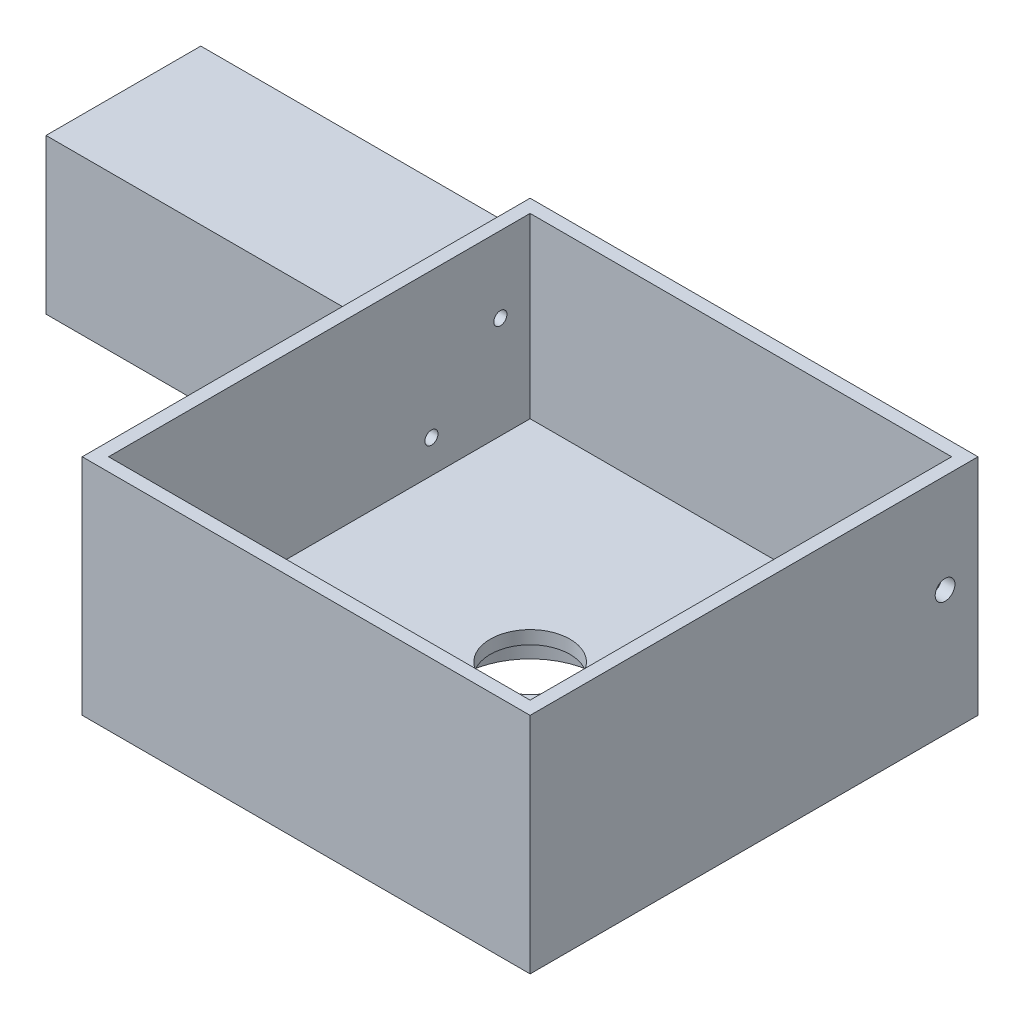
ISO-10303-21;
HEADER;
FILE_DESCRIPTION(('STEP AP214'),'2;1');
FILE_NAME('part.step','',(''),(''),'','','');
FILE_SCHEMA(('AUTOMOTIVE_DESIGN { 1 0 10303 214 1 1 1 1 }'));
ENDSEC;
DATA;
#1=APPLICATION_CONTEXT('core data for automotive mechanical design processes');
#2=APPLICATION_PROTOCOL_DEFINITION('international standard','automotive_design',2000,#1);
#3=PRODUCT_CONTEXT('',#1,'mechanical');
#4=PRODUCT('Part','Part','',(#3));
#5=PRODUCT_RELATED_PRODUCT_CATEGORY('part','',(#4));
#6=PRODUCT_DEFINITION_FORMATION('','',#4);
#7=PRODUCT_DEFINITION_CONTEXT('part definition',#1,'design');
#8=PRODUCT_DEFINITION('design','',#6,#7);
#9=PRODUCT_DEFINITION_SHAPE('','',#8);
#10=(LENGTH_UNIT() NAMED_UNIT(*) SI_UNIT(.MILLI.,.METRE.));
#11=(NAMED_UNIT(*) PLANE_ANGLE_UNIT() SI_UNIT($,.RADIAN.));
#12=(NAMED_UNIT(*) SI_UNIT($,.STERADIAN.) SOLID_ANGLE_UNIT());
#13=UNCERTAINTY_MEASURE_WITH_UNIT(LENGTH_MEASURE(1.E-05),#10,'distance_accuracy_value','');
#14=(GEOMETRIC_REPRESENTATION_CONTEXT(3) GLOBAL_UNCERTAINTY_ASSIGNED_CONTEXT((#13)) GLOBAL_UNIT_ASSIGNED_CONTEXT((#10,
#11,#12)) REPRESENTATION_CONTEXT('',''));
#15=CARTESIAN_POINT('',(0.,0.,0.));
#16=DIRECTION('',(0.,0.,1.));
#17=DIRECTION('',(1.,0.,0.));
#18=AXIS2_PLACEMENT_3D('',#15,#16,#17);
#19=CARTESIAN_POINT('',(34.,34.,34.));
#20=DIRECTION('',(-1.,0.,0.));
#21=DIRECTION('',(0.,0.,1.));
#22=AXIS2_PLACEMENT_3D('',#19,#20,#21);
#23=PLANE('',#22);
#24=CARTESIAN_POINT('',(34.,19.,-29.));
#25=DIRECTION('',(-1.,0.,0.));
#26=DIRECTION('',(0.,0.,1.));
#27=AXIS2_PLACEMENT_3D('',#24,#25,#26);
#28=CIRCLE('',#27,1.5);
#29=CARTESIAN_POINT('',(34.,19.,-27.5));
#30=VERTEX_POINT('',#29);
#31=EDGE_CURVE('E236',#30,#30,#28,.T.);
#32=ORIENTED_EDGE('',*,*,#31,.T.);
#33=EDGE_LOOP('',(#32));
#34=FACE_BOUND('',#33,.T.);
#35=DIRECTION('',(0.,0.,-1.));
#36=VECTOR('',#35,1.);
#37=CARTESIAN_POINT('',(34.,0.,34.));
#38=LINE('',#37,#36);
#39=CARTESIAN_POINT('',(34.,0.,34.));
#40=VERTEX_POINT('',#39);
#41=CARTESIAN_POINT('',(34.,0.,-34.));
#42=VERTEX_POINT('',#41);
#43=EDGE_CURVE('E349',#40,#42,#38,.T.);
#44=ORIENTED_EDGE('',*,*,#43,.T.);
#45=DIRECTION('',(0.,-1.,0.));
#46=VECTOR('',#45,1.);
#47=CARTESIAN_POINT('',(34.,34.,-34.));
#48=LINE('',#47,#46);
#49=CARTESIAN_POINT('',(34.,34.,-34.));
#50=VERTEX_POINT('',#49);
#51=EDGE_CURVE('E395',#50,#42,#48,.T.);
#52=ORIENTED_EDGE('',*,*,#51,.F.);
#53=DIRECTION('',(0.,0.,-1.));
#54=VECTOR('',#53,1.);
#55=CARTESIAN_POINT('',(34.,34.,34.));
#56=LINE('',#55,#54);
#57=CARTESIAN_POINT('',(34.,34.,34.));
#58=VERTEX_POINT('',#57);
#59=EDGE_CURVE('E359',#58,#50,#56,.T.);
#60=ORIENTED_EDGE('',*,*,#59,.F.);
#61=DIRECTION('',(0.,-1.,0.));
#62=VECTOR('',#61,1.);
#63=CARTESIAN_POINT('',(34.,34.,34.));
#64=LINE('',#63,#62);
#65=EDGE_CURVE('E373',#58,#40,#64,.T.);
#66=ORIENTED_EDGE('',*,*,#65,.T.);
#67=EDGE_LOOP('',(#44,#52,#60,#66));
#68=FACE_BOUND('',#67,.T.);
#69=ADVANCED_FACE('F39',(#34,#68),#23,.F.);
#70=CARTESIAN_POINT('',(-34.,34.,-34.));
#71=DIRECTION('',(0.,0.,1.));
#72=DIRECTION('',(1.,0.,0.));
#73=AXIS2_PLACEMENT_3D('',#70,#71,#72);
#74=PLANE('',#73);
#75=DIRECTION('',(-1.,0.,0.));
#76=VECTOR('',#75,1.);
#77=CARTESIAN_POINT('',(-34.,0.,-34.));
#78=LINE('',#77,#76);
#79=CARTESIAN_POINT('',(-34.,0.,-34.));
#80=VERTEX_POINT('',#79);
#81=EDGE_CURVE('E377',#42,#80,#78,.T.);
#82=ORIENTED_EDGE('',*,*,#81,.T.);
#83=DIRECTION('',(0.,-1.,0.));
#84=VECTOR('',#83,1.);
#85=CARTESIAN_POINT('',(-34.,34.,-34.));
#86=LINE('',#85,#84);
#87=CARTESIAN_POINT('',(-34.,5.5,-34.));
#88=VERTEX_POINT('',#87);
#89=EDGE_CURVE('E229',#88,#80,#86,.T.);
#90=ORIENTED_EDGE('',*,*,#89,.F.);
#91=DIRECTION('',(1.,0.,0.));
#92=VECTOR('',#91,1.);
#93=CARTESIAN_POINT('',(-84.,5.5,-34.));
#94=LINE('',#93,#92);
#95=CARTESIAN_POINT('',(-84.,5.5,-34.));
#96=VERTEX_POINT('',#95);
#97=EDGE_CURVE('E206',#96,#88,#94,.T.);
#98=ORIENTED_EDGE('',*,*,#97,.F.);
#99=DIRECTION('',(0.,-1.,0.));
#100=VECTOR('',#99,1.);
#101=CARTESIAN_POINT('',(-84.,5.5,-34.));
#102=LINE('',#101,#100);
#103=CARTESIAN_POINT('',(-84.,29.,-34.));
#104=VERTEX_POINT('',#103);
#105=EDGE_CURVE('E213',#104,#96,#102,.T.);
#106=ORIENTED_EDGE('',*,*,#105,.F.);
#107=DIRECTION('',(1.,0.,0.));
#108=VECTOR('',#107,1.);
#109=CARTESIAN_POINT('',(-84.,29.,-34.));
#110=LINE('',#109,#108);
#111=CARTESIAN_POINT('',(-34.,29.,-34.));
#112=VERTEX_POINT('',#111);
#113=EDGE_CURVE('E825',#104,#112,#110,.T.);
#114=ORIENTED_EDGE('',*,*,#113,.T.);
#115=CARTESIAN_POINT('',(-34.,34.,-34.));
#116=VERTEX_POINT('',#115);
#117=EDGE_CURVE('E392',#116,#112,#86,.T.);
#118=ORIENTED_EDGE('',*,*,#117,.F.);
#119=DIRECTION('',(-1.,0.,0.));
#120=VECTOR('',#119,1.);
#121=CARTESIAN_POINT('',(-34.,34.,-34.));
#122=LINE('',#121,#120);
#123=EDGE_CURVE('E363',#50,#116,#122,.T.);
#124=ORIENTED_EDGE('',*,*,#123,.F.);
#125=ORIENTED_EDGE('',*,*,#51,.T.);
#126=EDGE_LOOP('',(#82,#90,#98,#106,#114,#118,#124,#125));
#127=FACE_BOUND('',#126,.T.);
#128=ADVANCED_FACE('F228',(#127),#74,.F.);
#129=CARTESIAN_POINT('',(-34.,34.,34.));
#130=DIRECTION('',(1.,0.,0.));
#131=DIRECTION('',(0.,0.,-1.));
#132=AXIS2_PLACEMENT_3D('',#129,#130,#131);
#133=PLANE('',#132);
#134=DIRECTION('',(0.,0.,-1.));
#135=VECTOR('',#134,1.);
#136=CARTESIAN_POINT('',(-34.,29.,-34.));
#137=LINE('',#136,#135);
#138=CARTESIAN_POINT('',(-34.,29.,-10.5));
#139=VERTEX_POINT('',#138);
#140=EDGE_CURVE('E224',#139,#112,#137,.T.);
#141=ORIENTED_EDGE('',*,*,#140,.F.);
#142=DIRECTION('',(0.,1.,0.));
#143=VECTOR('',#142,1.);
#144=CARTESIAN_POINT('',(-34.,5.5,-10.5));
#145=LINE('',#144,#143);
#146=CARTESIAN_POINT('',(-34.,5.5,-10.5));
#147=VERTEX_POINT('',#146);
#148=EDGE_CURVE('E814',#147,#139,#145,.T.);
#149=ORIENTED_EDGE('',*,*,#148,.F.);
#150=DIRECTION('',(0.,0.,1.));
#151=VECTOR('',#150,1.);
#152=CARTESIAN_POINT('',(-34.,5.5,-34.));
#153=LINE('',#152,#151);
#154=EDGE_CURVE('E822',#88,#147,#153,.T.);
#155=ORIENTED_EDGE('',*,*,#154,.F.);
#156=ORIENTED_EDGE('',*,*,#89,.T.);
#157=DIRECTION('',(0.,0.,1.));
#158=VECTOR('',#157,1.);
#159=CARTESIAN_POINT('',(-34.,0.,34.));
#160=LINE('',#159,#158);
#161=CARTESIAN_POINT('',(-34.,0.,34.));
#162=VERTEX_POINT('',#161);
#163=EDGE_CURVE('E380',#80,#162,#160,.T.);
#164=ORIENTED_EDGE('',*,*,#163,.T.);
#165=DIRECTION('',(0.,-1.,0.));
#166=VECTOR('',#165,1.);
#167=CARTESIAN_POINT('',(-34.,34.,34.));
#168=LINE('',#167,#166);
#169=CARTESIAN_POINT('',(-34.,34.,34.));
#170=VERTEX_POINT('',#169);
#171=EDGE_CURVE('E388',#170,#162,#168,.T.);
#172=ORIENTED_EDGE('',*,*,#171,.F.);
#173=DIRECTION('',(0.,0.,1.));
#174=VECTOR('',#173,1.);
#175=CARTESIAN_POINT('',(-34.,34.,34.));
#176=LINE('',#175,#174);
#177=EDGE_CURVE('E367',#116,#170,#176,.T.);
#178=ORIENTED_EDGE('',*,*,#177,.F.);
#179=ORIENTED_EDGE('',*,*,#117,.T.);
#180=EDGE_LOOP('',(#141,#149,#155,#156,#164,#172,#178,#179));
#181=FACE_BOUND('',#180,.T.);
#182=ADVANCED_FACE('F524',(#181),#133,.F.);
#183=CARTESIAN_POINT('',(-34.,34.,34.));
#184=DIRECTION('',(0.,0.,-1.));
#185=DIRECTION('',(-1.,0.,0.));
#186=AXIS2_PLACEMENT_3D('',#183,#184,#185);
#187=PLANE('',#186);
#188=DIRECTION('',(1.,0.,0.));
#189=VECTOR('',#188,1.);
#190=CARTESIAN_POINT('',(-34.,0.,34.));
#191=LINE('',#190,#189);
#192=EDGE_CURVE('E364',#162,#40,#191,.T.);
#193=ORIENTED_EDGE('',*,*,#192,.T.);
#194=ORIENTED_EDGE('',*,*,#65,.F.);
#195=DIRECTION('',(1.,0.,0.));
#196=VECTOR('',#195,1.);
#197=CARTESIAN_POINT('',(-34.,34.,34.));
#198=LINE('',#197,#196);
#199=EDGE_CURVE('E370',#170,#58,#198,.T.);
#200=ORIENTED_EDGE('',*,*,#199,.F.);
#201=ORIENTED_EDGE('',*,*,#171,.T.);
#202=EDGE_LOOP('',(#193,#194,#200,#201));
#203=FACE_BOUND('',#202,.T.);
#204=ADVANCED_FACE('F805',(#203),#187,.F.);
#205=CARTESIAN_POINT('',(0.,34.,0.));
#206=DIRECTION('',(0.,-1.,0.));
#207=DIRECTION('',(0.,0.,-1.));
#208=AXIS2_PLACEMENT_3D('',#205,#206,#207);
#209=PLANE('',#208);
#210=DIRECTION('',(-1.,0.,0.));
#211=VECTOR('',#210,1.);
#212=CARTESIAN_POINT('',(0.,34.,-32.));
#213=LINE('',#212,#211);
#214=CARTESIAN_POINT('',(32.,34.,-32.));
#215=VERTEX_POINT('',#214);
#216=CARTESIAN_POINT('',(-32.,34.,-32.));
#217=VERTEX_POINT('',#216);
#218=EDGE_CURVE('E335',#215,#217,#213,.T.);
#219=ORIENTED_EDGE('',*,*,#218,.F.);
#220=DIRECTION('',(0.,0.,-1.));
#221=VECTOR('',#220,1.);
#222=CARTESIAN_POINT('',(32.,34.,0.));
#223=LINE('',#222,#221);
#224=CARTESIAN_POINT('',(32.,34.,32.));
#225=VERTEX_POINT('',#224);
#226=EDGE_CURVE('E311',#225,#215,#223,.T.);
#227=ORIENTED_EDGE('',*,*,#226,.F.);
#228=DIRECTION('',(1.,0.,0.));
#229=VECTOR('',#228,1.);
#230=CARTESIAN_POINT('',(0.,34.,32.));
#231=LINE('',#230,#229);
#232=CARTESIAN_POINT('',(-32.,34.,32.));
#233=VERTEX_POINT('',#232);
#234=EDGE_CURVE('E320',#233,#225,#231,.T.);
#235=ORIENTED_EDGE('',*,*,#234,.F.);
#236=DIRECTION('',(0.,0.,1.));
#237=VECTOR('',#236,1.);
#238=CARTESIAN_POINT('',(-32.,34.,0.));
#239=LINE('',#238,#237);
#240=EDGE_CURVE('E339',#217,#233,#239,.T.);
#241=ORIENTED_EDGE('',*,*,#240,.F.);
#242=EDGE_LOOP('',(#219,#227,#235,#241));
#243=FACE_BOUND('',#242,.T.);
#244=ORIENTED_EDGE('',*,*,#59,.T.);
#245=ORIENTED_EDGE('',*,*,#123,.T.);
#246=ORIENTED_EDGE('',*,*,#177,.T.);
#247=ORIENTED_EDGE('',*,*,#199,.T.);
#248=EDGE_LOOP('',(#244,#245,#246,#247));
#249=FACE_BOUND('',#248,.T.);
#250=ADVANCED_FACE('F744',(#243,#249),#209,.F.);
#251=CARTESIAN_POINT('',(0.,0.,0.));
#252=DIRECTION('',(0.,-1.,0.));
#253=DIRECTION('',(0.,0.,-1.));
#254=AXIS2_PLACEMENT_3D('',#251,#252,#253);
#255=PLANE('',#254);
#256=DIRECTION('',(0.,0.,-1.));
#257=VECTOR('',#256,1.);
#258=CARTESIAN_POINT('',(-15.5,0.,15.));
#259=LINE('',#258,#257);
#260=CARTESIAN_POINT('',(-15.5,0.,-15.5));
#261=VERTEX_POINT('',#260);
#262=CARTESIAN_POINT('',(-15.5,0.,15.5));
#263=VERTEX_POINT('',#262);
#264=EDGE_CURVE('E435',#261,#263,#259,.F.);
#265=ORIENTED_EDGE('',*,*,#264,.T.);
#266=DIRECTION('',(-1.,0.,0.));
#267=VECTOR('',#266,1.);
#268=CARTESIAN_POINT('',(15.,0.,15.5));
#269=LINE('',#268,#267);
#270=CARTESIAN_POINT('',(15.5,0.,15.5));
#271=VERTEX_POINT('',#270);
#272=EDGE_CURVE('E444',#263,#271,#269,.F.);
#273=ORIENTED_EDGE('',*,*,#272,.T.);
#274=DIRECTION('',(0.,0.,1.));
#275=VECTOR('',#274,1.);
#276=CARTESIAN_POINT('',(15.5,0.,-15.));
#277=LINE('',#276,#275);
#278=CARTESIAN_POINT('',(15.5,0.,-15.5));
#279=VERTEX_POINT('',#278);
#280=EDGE_CURVE('E441',#271,#279,#277,.F.);
#281=ORIENTED_EDGE('',*,*,#280,.T.);
#282=DIRECTION('',(1.,0.,0.));
#283=VECTOR('',#282,1.);
#284=CARTESIAN_POINT('',(-15.,0.,-15.5));
#285=LINE('',#284,#283);
#286=EDGE_CURVE('E438',#279,#261,#285,.F.);
#287=ORIENTED_EDGE('',*,*,#286,.T.);
#288=EDGE_LOOP('',(#265,#273,#281,#287));
#289=FACE_BOUND('',#288,.T.);
#290=ORIENTED_EDGE('',*,*,#43,.F.);
#291=ORIENTED_EDGE('',*,*,#192,.F.);
#292=ORIENTED_EDGE('',*,*,#163,.F.);
#293=ORIENTED_EDGE('',*,*,#81,.F.);
#294=EDGE_LOOP('',(#290,#291,#292,#293));
#295=FACE_BOUND('',#294,.T.);
#296=ADVANCED_FACE('F488',(#289,#295),#255,.T.);
#297=CARTESIAN_POINT('',(32.,7.,0.));
#298=DIRECTION('',(1.,0.,0.));
#299=DIRECTION('',(0.,0.,-1.));
#300=AXIS2_PLACEMENT_3D('',#297,#298,#299);
#301=PLANE('',#300);
#302=CARTESIAN_POINT('',(32.,19.,-29.));
#303=DIRECTION('',(-1.,0.,0.));
#304=DIRECTION('',(0.,0.,1.));
#305=AXIS2_PLACEMENT_3D('',#302,#303,#304);
#306=CIRCLE('',#305,1.5);
#307=CARTESIAN_POINT('',(32.,19.,-27.5));
#308=VERTEX_POINT('',#307);
#309=EDGE_CURVE('E231',#308,#308,#306,.T.);
#310=ORIENTED_EDGE('',*,*,#309,.F.);
#311=EDGE_LOOP('',(#310));
#312=FACE_BOUND('',#311,.T.);
#313=ORIENTED_EDGE('',*,*,#226,.T.);
#314=DIRECTION('',(0.,1.,0.));
#315=VECTOR('',#314,1.);
#316=CARTESIAN_POINT('',(32.,7.,-32.));
#317=LINE('',#316,#315);
#318=CARTESIAN_POINT('',(32.,7.,-32.));
#319=VERTEX_POINT('',#318);
#320=EDGE_CURVE('E332',#319,#215,#317,.T.);
#321=ORIENTED_EDGE('',*,*,#320,.F.);
#322=DIRECTION('',(0.,0.,-1.));
#323=VECTOR('',#322,1.);
#324=CARTESIAN_POINT('',(32.,7.,0.));
#325=LINE('',#324,#323);
#326=CARTESIAN_POINT('',(32.,7.,32.));
#327=VERTEX_POINT('',#326);
#328=EDGE_CURVE('E315',#327,#319,#325,.T.);
#329=ORIENTED_EDGE('',*,*,#328,.F.);
#330=DIRECTION('',(0.,1.,0.));
#331=VECTOR('',#330,1.);
#332=CARTESIAN_POINT('',(32.,7.,32.));
#333=LINE('',#332,#331);
#334=EDGE_CURVE('E346',#327,#225,#333,.T.);
#335=ORIENTED_EDGE('',*,*,#334,.T.);
#336=EDGE_LOOP('',(#313,#321,#329,#335));
#337=FACE_BOUND('',#336,.T.);
#338=ADVANCED_FACE('F743',(#312,#337),#301,.F.);
#339=CARTESIAN_POINT('',(0.,7.,32.));
#340=DIRECTION('',(0.,0.,1.));
#341=DIRECTION('',(1.,0.,0.));
#342=AXIS2_PLACEMENT_3D('',#339,#340,#341);
#343=PLANE('',#342);
#344=ORIENTED_EDGE('',*,*,#234,.T.);
#345=ORIENTED_EDGE('',*,*,#334,.F.);
#346=DIRECTION('',(1.,0.,0.));
#347=VECTOR('',#346,1.);
#348=CARTESIAN_POINT('',(0.,7.,32.));
#349=LINE('',#348,#347);
#350=CARTESIAN_POINT('',(-32.,7.,32.));
#351=VERTEX_POINT('',#350);
#352=EDGE_CURVE('E328',#351,#327,#349,.T.);
#353=ORIENTED_EDGE('',*,*,#352,.F.);
#354=DIRECTION('',(0.,1.,0.));
#355=VECTOR('',#354,1.);
#356=CARTESIAN_POINT('',(-32.,7.,32.));
#357=LINE('',#356,#355);
#358=EDGE_CURVE('E350',#351,#233,#357,.T.);
#359=ORIENTED_EDGE('',*,*,#358,.T.);
#360=EDGE_LOOP('',(#344,#345,#353,#359));
#361=FACE_BOUND('',#360,.T.);
#362=ADVANCED_FACE('F757',(#361),#343,.F.);
#363=CARTESIAN_POINT('',(-32.,7.,0.));
#364=DIRECTION('',(-1.,0.,0.));
#365=DIRECTION('',(0.,0.,1.));
#366=AXIS2_PLACEMENT_3D('',#363,#364,#365);
#367=PLANE('',#366);
#368=CARTESIAN_POINT('',(-32.,22.4825901807804,-27.4825901807805));
#369=DIRECTION('',(-1.,0.,0.));
#370=DIRECTION('',(0.,0.,1.));
#371=AXIS2_PLACEMENT_3D('',#368,#369,#370);
#372=CIRCLE('',#371,1.);
#373=CARTESIAN_POINT('',(-32.,22.4825901807804,-26.4825901807805));
#374=VERTEX_POINT('',#373);
#375=EDGE_CURVE('E840',#374,#374,#372,.T.);
#376=ORIENTED_EDGE('',*,*,#375,.T.);
#377=EDGE_LOOP('',(#376));
#378=FACE_BOUND('',#377,.T.);
#379=CARTESIAN_POINT('',(-32.,12.0174098192195,-17.0174098192196));
#380=DIRECTION('',(-1.,0.,0.));
#381=DIRECTION('',(0.,0.,-1.));
#382=AXIS2_PLACEMENT_3D('',#379,#380,#381);
#383=CIRCLE('',#382,1.);
#384=CARTESIAN_POINT('',(-32.,12.0174098192195,-18.0174098192196));
#385=VERTEX_POINT('',#384);
#386=EDGE_CURVE('E848',#385,#385,#383,.T.);
#387=ORIENTED_EDGE('',*,*,#386,.T.);
#388=EDGE_LOOP('',(#387));
#389=FACE_BOUND('',#388,.T.);
#390=ORIENTED_EDGE('',*,*,#240,.T.);
#391=ORIENTED_EDGE('',*,*,#358,.F.);
#392=DIRECTION('',(0.,0.,1.));
#393=VECTOR('',#392,1.);
#394=CARTESIAN_POINT('',(-32.,7.,0.));
#395=LINE('',#394,#393);
#396=CARTESIAN_POINT('',(-32.,7.,-32.));
#397=VERTEX_POINT('',#396);
#398=EDGE_CURVE('E324',#397,#351,#395,.T.);
#399=ORIENTED_EDGE('',*,*,#398,.F.);
#400=DIRECTION('',(0.,1.,0.));
#401=VECTOR('',#400,1.);
#402=CARTESIAN_POINT('',(-32.,7.,-32.));
#403=LINE('',#402,#401);
#404=EDGE_CURVE('E353',#397,#217,#403,.T.);
#405=ORIENTED_EDGE('',*,*,#404,.T.);
#406=EDGE_LOOP('',(#390,#391,#399,#405));
#407=FACE_BOUND('',#406,.T.);
#408=ADVANCED_FACE('F764',(#378,#389,#407),#367,.F.);
#409=CARTESIAN_POINT('',(0.,7.,-32.));
#410=DIRECTION('',(0.,0.,-1.));
#411=DIRECTION('',(-1.,0.,0.));
#412=AXIS2_PLACEMENT_3D('',#409,#410,#411);
#413=PLANE('',#412);
#414=ORIENTED_EDGE('',*,*,#218,.T.);
#415=ORIENTED_EDGE('',*,*,#404,.F.);
#416=DIRECTION('',(-1.,0.,0.));
#417=VECTOR('',#416,1.);
#418=CARTESIAN_POINT('',(0.,7.,-32.));
#419=LINE('',#418,#417);
#420=EDGE_CURVE('E319',#319,#397,#419,.T.);
#421=ORIENTED_EDGE('',*,*,#420,.F.);
#422=ORIENTED_EDGE('',*,*,#320,.T.);
#423=EDGE_LOOP('',(#414,#415,#421,#422));
#424=FACE_BOUND('',#423,.T.);
#425=ADVANCED_FACE('F771',(#424),#413,.F.);
#426=CARTESIAN_POINT('',(0.,7.,0.));
#427=DIRECTION('',(0.,1.,0.));
#428=DIRECTION('',(0.,0.,1.));
#429=AXIS2_PLACEMENT_3D('',#426,#427,#428);
#430=PLANE('',#429);
#431=CARTESIAN_POINT('',(0.,7.,0.));
#432=DIRECTION('',(0.,1.,0.));
#433=DIRECTION('',(0.,0.,1.));
#434=AXIS2_PLACEMENT_3D('',#431,#432,#433);
#435=CIRCLE('',#434,6.05);
#436=CARTESIAN_POINT('',(0.,7.,6.05));
#437=VERTEX_POINT('',#436);
#438=EDGE_CURVE('E404',#437,#437,#435,.F.);
#439=ORIENTED_EDGE('',*,*,#438,.T.);
#440=EDGE_LOOP('',(#439));
#441=FACE_BOUND('',#440,.T.);
#442=ORIENTED_EDGE('',*,*,#328,.T.);
#443=ORIENTED_EDGE('',*,*,#420,.T.);
#444=ORIENTED_EDGE('',*,*,#398,.T.);
#445=ORIENTED_EDGE('',*,*,#352,.T.);
#446=EDGE_LOOP('',(#442,#443,#444,#445));
#447=FACE_BOUND('',#446,.T.);
#448=ADVANCED_FACE('F515',(#441,#447),#430,.T.);
#449=CARTESIAN_POINT('',(15.,2.,-15.));
#450=DIRECTION('',(1.,0.,0.));
#451=DIRECTION('',(0.,0.,-1.));
#452=AXIS2_PLACEMENT_3D('',#449,#450,#451);
#453=PLANE('',#452);
#454=DIRECTION('',(0.,-1.,0.));
#455=VECTOR('',#454,1.);
#456=CARTESIAN_POINT('',(15.,2.,-15.));
#457=LINE('',#456,#455);
#458=CARTESIAN_POINT('',(15.,2.,-15.));
#459=VERTEX_POINT('',#458);
#460=CARTESIAN_POINT('',(15.,0.5,-15.));
#461=VERTEX_POINT('',#460);
#462=EDGE_CURVE('E294',#459,#461,#457,.T.);
#463=ORIENTED_EDGE('',*,*,#462,.T.);
#464=DIRECTION('',(0.,0.,1.));
#465=VECTOR('',#464,1.);
#466=CARTESIAN_POINT('',(15.,0.5,15.));
#467=LINE('',#466,#465);
#468=CARTESIAN_POINT('',(15.,0.5,15.));
#469=VERTEX_POINT('',#468);
#470=EDGE_CURVE('E448',#461,#469,#467,.T.);
#471=ORIENTED_EDGE('',*,*,#470,.T.);
#472=DIRECTION('',(0.,-1.,0.));
#473=VECTOR('',#472,1.);
#474=CARTESIAN_POINT('',(15.,2.,15.));
#475=LINE('',#474,#473);
#476=CARTESIAN_POINT('',(15.,2.,15.));
#477=VERTEX_POINT('',#476);
#478=EDGE_CURVE('E293',#477,#469,#475,.T.);
#479=ORIENTED_EDGE('',*,*,#478,.F.);
#480=DIRECTION('',(0.,0.,1.));
#481=VECTOR('',#480,1.);
#482=CARTESIAN_POINT('',(15.,2.,-15.));
#483=LINE('',#482,#481);
#484=EDGE_CURVE('E266',#459,#477,#483,.T.);
#485=ORIENTED_EDGE('',*,*,#484,.F.);
#486=EDGE_LOOP('',(#463,#471,#479,#485));
#487=FACE_BOUND('',#486,.T.);
#488=ADVANCED_FACE('F506',(#487),#453,.F.);
#489=CARTESIAN_POINT('',(15.,2.,-15.));
#490=DIRECTION('',(0.,0.,-1.));
#491=DIRECTION('',(-1.,0.,0.));
#492=AXIS2_PLACEMENT_3D('',#489,#490,#491);
#493=PLANE('',#492);
#494=DIRECTION('',(0.,-1.,0.));
#495=VECTOR('',#494,1.);
#496=CARTESIAN_POINT('',(-15.,2.,-15.));
#497=LINE('',#496,#495);
#498=CARTESIAN_POINT('',(-15.,2.,-15.));
#499=VERTEX_POINT('',#498);
#500=CARTESIAN_POINT('',(-15.,0.5,-15.));
#501=VERTEX_POINT('',#500);
#502=EDGE_CURVE('E298',#499,#501,#497,.T.);
#503=ORIENTED_EDGE('',*,*,#502,.T.);
#504=DIRECTION('',(1.,0.,0.));
#505=VECTOR('',#504,1.);
#506=CARTESIAN_POINT('',(15.,0.5,-15.));
#507=LINE('',#506,#505);
#508=EDGE_CURVE('E49',#501,#461,#507,.T.);
#509=ORIENTED_EDGE('',*,*,#508,.T.);
#510=ORIENTED_EDGE('',*,*,#462,.F.);
#511=DIRECTION('',(1.,0.,0.));
#512=VECTOR('',#511,1.);
#513=CARTESIAN_POINT('',(15.,2.,-15.));
#514=LINE('',#513,#512);
#515=EDGE_CURVE('E289',#499,#459,#514,.T.);
#516=ORIENTED_EDGE('',*,*,#515,.F.);
#517=EDGE_LOOP('',(#503,#509,#510,#516));
#518=FACE_BOUND('',#517,.T.);
#519=ADVANCED_FACE('F507',(#518),#493,.F.);
#520=CARTESIAN_POINT('',(-15.,2.,-15.));
#521=DIRECTION('',(-1.,0.,0.));
#522=DIRECTION('',(0.,0.,1.));
#523=AXIS2_PLACEMENT_3D('',#520,#521,#522);
#524=PLANE('',#523);
#525=DIRECTION('',(0.,-1.,0.));
#526=VECTOR('',#525,1.);
#527=CARTESIAN_POINT('',(-15.,2.,15.));
#528=LINE('',#527,#526);
#529=CARTESIAN_POINT('',(-15.,2.,15.));
#530=VERTEX_POINT('',#529);
#531=CARTESIAN_POINT('',(-15.,0.5,15.));
#532=VERTEX_POINT('',#531);
#533=EDGE_CURVE('E301',#530,#532,#528,.T.);
#534=ORIENTED_EDGE('',*,*,#533,.T.);
#535=DIRECTION('',(0.,0.,-1.));
#536=VECTOR('',#535,1.);
#537=CARTESIAN_POINT('',(-15.,0.5,-15.));
#538=LINE('',#537,#536);
#539=EDGE_CURVE('E11',#532,#501,#538,.T.);
#540=ORIENTED_EDGE('',*,*,#539,.T.);
#541=ORIENTED_EDGE('',*,*,#502,.F.);
#542=DIRECTION('',(0.,0.,-1.));
#543=VECTOR('',#542,1.);
#544=CARTESIAN_POINT('',(-15.,2.,-15.));
#545=LINE('',#544,#543);
#546=EDGE_CURVE('E285',#530,#499,#545,.T.);
#547=ORIENTED_EDGE('',*,*,#546,.F.);
#548=EDGE_LOOP('',(#534,#540,#541,#547));
#549=FACE_BOUND('',#548,.T.);
#550=ADVANCED_FACE('F500',(#549),#524,.F.);
#551=CARTESIAN_POINT('',(15.,2.,15.));
#552=DIRECTION('',(0.,0.,1.));
#553=DIRECTION('',(1.,0.,0.));
#554=AXIS2_PLACEMENT_3D('',#551,#552,#553);
#555=PLANE('',#554);
#556=ORIENTED_EDGE('',*,*,#478,.T.);
#557=DIRECTION('',(-1.,0.,0.));
#558=VECTOR('',#557,1.);
#559=CARTESIAN_POINT('',(-15.,0.5,15.));
#560=LINE('',#559,#558);
#561=EDGE_CURVE('E431',#469,#532,#560,.T.);
#562=ORIENTED_EDGE('',*,*,#561,.T.);
#563=ORIENTED_EDGE('',*,*,#533,.F.);
#564=DIRECTION('',(-1.,0.,0.));
#565=VECTOR('',#564,1.);
#566=CARTESIAN_POINT('',(15.,2.,15.));
#567=LINE('',#566,#565);
#568=EDGE_CURVE('E281',#477,#530,#567,.T.);
#569=ORIENTED_EDGE('',*,*,#568,.F.);
#570=EDGE_LOOP('',(#556,#562,#563,#569));
#571=FACE_BOUND('',#570,.T.);
#572=ADVANCED_FACE('F497',(#571),#555,.F.);
#573=CARTESIAN_POINT('',(0.,2.,0.));
#574=DIRECTION('',(0.,-1.,0.));
#575=DIRECTION('',(0.,0.,-1.));
#576=AXIS2_PLACEMENT_3D('',#573,#574,#575);
#577=PLANE('',#576);
#578=DIRECTION('',(1.,0.,0.));
#579=VECTOR('',#578,1.);
#580=CARTESIAN_POINT('',(13.,2.,-13.));
#581=LINE('',#580,#579);
#582=CARTESIAN_POINT('',(-13.,2.,-13.));
#583=VERTEX_POINT('',#582);
#584=CARTESIAN_POINT('',(13.,2.,-13.));
#585=VERTEX_POINT('',#584);
#586=EDGE_CURVE('E257',#583,#585,#581,.T.);
#587=ORIENTED_EDGE('',*,*,#586,.F.);
#588=DIRECTION('',(0.,0.,-1.));
#589=VECTOR('',#588,1.);
#590=CARTESIAN_POINT('',(-13.,2.,-13.));
#591=LINE('',#590,#589);
#592=CARTESIAN_POINT('',(-13.,2.,13.));
#593=VERTEX_POINT('',#592);
#594=EDGE_CURVE('E253',#593,#583,#591,.T.);
#595=ORIENTED_EDGE('',*,*,#594,.F.);
#596=DIRECTION('',(-1.,0.,0.));
#597=VECTOR('',#596,1.);
#598=CARTESIAN_POINT('',(13.,2.,13.));
#599=LINE('',#598,#597);
#600=CARTESIAN_POINT('',(13.,2.,13.));
#601=VERTEX_POINT('',#600);
#602=EDGE_CURVE('E249',#601,#593,#599,.T.);
#603=ORIENTED_EDGE('',*,*,#602,.F.);
#604=DIRECTION('',(0.,0.,1.));
#605=VECTOR('',#604,1.);
#606=CARTESIAN_POINT('',(13.,2.,-13.));
#607=LINE('',#606,#605);
#608=EDGE_CURVE('E244',#585,#601,#607,.T.);
#609=ORIENTED_EDGE('',*,*,#608,.F.);
#610=EDGE_LOOP('',(#587,#595,#603,#609));
#611=FACE_BOUND('',#610,.T.);
#612=ORIENTED_EDGE('',*,*,#484,.T.);
#613=ORIENTED_EDGE('',*,*,#568,.T.);
#614=ORIENTED_EDGE('',*,*,#546,.T.);
#615=ORIENTED_EDGE('',*,*,#515,.T.);
#616=EDGE_LOOP('',(#612,#613,#614,#615));
#617=FACE_BOUND('',#616,.T.);
#618=ADVANCED_FACE('F503',(#611,#617),#577,.T.);
#619=CARTESIAN_POINT('',(13.,2.,-13.));
#620=DIRECTION('',(1.,0.,0.));
#621=DIRECTION('',(0.,0.,-1.));
#622=AXIS2_PLACEMENT_3D('',#619,#620,#621);
#623=PLANE('',#622);
#624=DIRECTION('',(0.,-1.,0.));
#625=VECTOR('',#624,1.);
#626=CARTESIAN_POINT('',(13.,2.,13.));
#627=LINE('',#626,#625);
#628=CARTESIAN_POINT('',(13.,0.5,13.));
#629=VERTEX_POINT('',#628);
#630=EDGE_CURVE('E261',#601,#629,#627,.T.);
#631=ORIENTED_EDGE('',*,*,#630,.T.);
#632=DIRECTION('',(0.,0.,1.));
#633=VECTOR('',#632,1.);
#634=CARTESIAN_POINT('',(13.,0.5,-13.));
#635=LINE('',#634,#633);
#636=CARTESIAN_POINT('',(13.,0.5,-13.));
#637=VERTEX_POINT('',#636);
#638=EDGE_CURVE('E422',#629,#637,#635,.F.);
#639=ORIENTED_EDGE('',*,*,#638,.T.);
#640=DIRECTION('',(0.,-1.,0.));
#641=VECTOR('',#640,1.);
#642=CARTESIAN_POINT('',(13.,2.,-13.));
#643=LINE('',#642,#641);
#644=EDGE_CURVE('E262',#585,#637,#643,.T.);
#645=ORIENTED_EDGE('',*,*,#644,.F.);
#646=ORIENTED_EDGE('',*,*,#608,.T.);
#647=EDGE_LOOP('',(#631,#639,#645,#646));
#648=FACE_BOUND('',#647,.T.);
#649=ADVANCED_FACE('F701',(#648),#623,.T.);
#650=CARTESIAN_POINT('',(13.,2.,-13.));
#651=DIRECTION('',(0.,0.,-1.));
#652=DIRECTION('',(-1.,0.,0.));
#653=AXIS2_PLACEMENT_3D('',#650,#651,#652);
#654=PLANE('',#653);
#655=ORIENTED_EDGE('',*,*,#644,.T.);
#656=DIRECTION('',(1.,0.,0.));
#657=VECTOR('',#656,1.);
#658=CARTESIAN_POINT('',(13.,0.5,-13.));
#659=LINE('',#658,#657);
#660=CARTESIAN_POINT('',(-13.,0.5,-13.));
#661=VERTEX_POINT('',#660);
#662=EDGE_CURVE('E425',#637,#661,#659,.F.);
#663=ORIENTED_EDGE('',*,*,#662,.T.);
#664=DIRECTION('',(0.,-1.,0.));
#665=VECTOR('',#664,1.);
#666=CARTESIAN_POINT('',(-13.,2.,-13.));
#667=LINE('',#666,#665);
#668=EDGE_CURVE('E267',#583,#661,#667,.T.);
#669=ORIENTED_EDGE('',*,*,#668,.F.);
#670=ORIENTED_EDGE('',*,*,#586,.T.);
#671=EDGE_LOOP('',(#655,#663,#669,#670));
#672=FACE_BOUND('',#671,.T.);
#673=ADVANCED_FACE('F693',(#672),#654,.T.);
#674=CARTESIAN_POINT('',(-13.,2.,-13.));
#675=DIRECTION('',(-1.,0.,0.));
#676=DIRECTION('',(0.,0.,1.));
#677=AXIS2_PLACEMENT_3D('',#674,#675,#676);
#678=PLANE('',#677);
#679=ORIENTED_EDGE('',*,*,#668,.T.);
#680=DIRECTION('',(0.,0.,-1.));
#681=VECTOR('',#680,1.);
#682=CARTESIAN_POINT('',(-13.,0.5,-13.));
#683=LINE('',#682,#681);
#684=CARTESIAN_POINT('',(-13.,0.5,13.));
#685=VERTEX_POINT('',#684);
#686=EDGE_CURVE('E428',#661,#685,#683,.F.);
#687=ORIENTED_EDGE('',*,*,#686,.T.);
#688=DIRECTION('',(0.,-1.,0.));
#689=VECTOR('',#688,1.);
#690=CARTESIAN_POINT('',(-13.,2.,13.));
#691=LINE('',#690,#689);
#692=EDGE_CURVE('E271',#593,#685,#691,.T.);
#693=ORIENTED_EDGE('',*,*,#692,.F.);
#694=ORIENTED_EDGE('',*,*,#594,.T.);
#695=EDGE_LOOP('',(#679,#687,#693,#694));
#696=FACE_BOUND('',#695,.T.);
#697=ADVANCED_FACE('F685',(#696),#678,.T.);
#698=CARTESIAN_POINT('',(13.,2.,13.));
#699=DIRECTION('',(0.,0.,1.));
#700=DIRECTION('',(1.,0.,0.));
#701=AXIS2_PLACEMENT_3D('',#698,#699,#700);
#702=PLANE('',#701);
#703=ORIENTED_EDGE('',*,*,#692,.T.);
#704=DIRECTION('',(-1.,0.,0.));
#705=VECTOR('',#704,1.);
#706=CARTESIAN_POINT('',(13.,0.5,13.));
#707=LINE('',#706,#705);
#708=EDGE_CURVE('E418',#685,#629,#707,.F.);
#709=ORIENTED_EDGE('',*,*,#708,.T.);
#710=ORIENTED_EDGE('',*,*,#630,.F.);
#711=ORIENTED_EDGE('',*,*,#602,.T.);
#712=EDGE_LOOP('',(#703,#709,#710,#711));
#713=FACE_BOUND('',#712,.T.);
#714=ADVANCED_FACE('F678',(#713),#702,.T.);
#715=CARTESIAN_POINT('',(0.,5.,0.));
#716=DIRECTION('',(0.,-1.,0.));
#717=DIRECTION('',(0.,0.,-1.));
#718=AXIS2_PLACEMENT_3D('',#715,#716,#717);
#719=PLANE('',#718);
#720=CARTESIAN_POINT('',(0.,5.,0.));
#721=DIRECTION('',(0.,-1.,0.));
#722=DIRECTION('',(0.,0.,-1.));
#723=AXIS2_PLACEMENT_3D('',#720,#721,#722);
#724=CIRCLE('',#723,6.05);
#725=CARTESIAN_POINT('',(0.,5.,-6.05));
#726=VERTEX_POINT('',#725);
#727=EDGE_CURVE('E400',#726,#726,#724,.F.);
#728=ORIENTED_EDGE('',*,*,#727,.T.);
#729=EDGE_LOOP('',(#728));
#730=FACE_BOUND('',#729,.T.);
#731=CARTESIAN_POINT('',(0.,5.,0.));
#732=DIRECTION('',(0.,-1.,0.));
#733=DIRECTION('',(0.,0.,-1.));
#734=AXIS2_PLACEMENT_3D('',#731,#732,#733);
#735=CIRCLE('',#734,10.5);
#736=CARTESIAN_POINT('',(0.,5.,-10.5));
#737=VERTEX_POINT('',#736);
#738=EDGE_CURVE('E307',#737,#737,#735,.T.);
#739=ORIENTED_EDGE('',*,*,#738,.T.);
#740=EDGE_LOOP('',(#739));
#741=FACE_BOUND('',#740,.T.);
#742=ADVANCED_FACE('F669',(#730,#741),#719,.T.);
#743=CARTESIAN_POINT('',(0.,5.,0.));
#744=DIRECTION('',(0.,-1.,0.));
#745=DIRECTION('',(0.,0.,-1.));
#746=AXIS2_PLACEMENT_3D('',#743,#744,#745);
#747=CYLINDRICAL_SURFACE('',#746,10.5);
#748=ORIENTED_EDGE('',*,*,#738,.F.);
#749=EDGE_LOOP('',(#748));
#750=FACE_BOUND('',#749,.T.);
#751=CARTESIAN_POINT('',(0.,0.,0.));
#752=DIRECTION('',(0.,-1.,0.));
#753=DIRECTION('',(0.,0.,-1.));
#754=AXIS2_PLACEMENT_3D('',#751,#752,#753);
#755=CIRCLE('',#754,10.5);
#756=CARTESIAN_POINT('',(0.,0.,-10.5));
#757=VERTEX_POINT('',#756);
#758=EDGE_CURVE('E297',#757,#757,#755,.T.);
#759=ORIENTED_EDGE('',*,*,#758,.T.);
#760=EDGE_LOOP('',(#759));
#761=FACE_BOUND('',#760,.T.);
#762=ADVANCED_FACE('F660',(#750,#761),#747,.F.);
#763=DIRECTION('',(0.,0.,1.));
#764=VECTOR('',#763,1.);
#765=CARTESIAN_POINT('',(12.5,0.,0.));
#766=LINE('',#765,#764);
#767=CARTESIAN_POINT('',(12.5,0.,-12.5));
#768=VERTEX_POINT('',#767);
#769=CARTESIAN_POINT('',(12.5,0.,12.5));
#770=VERTEX_POINT('',#769);
#771=EDGE_CURVE('E411',#768,#770,#766,.T.);
#772=ORIENTED_EDGE('',*,*,#771,.T.);
#773=DIRECTION('',(-1.,0.,0.));
#774=VECTOR('',#773,1.);
#775=CARTESIAN_POINT('',(0.,0.,12.5));
#776=LINE('',#775,#774);
#777=CARTESIAN_POINT('',(-12.5,0.,12.5));
#778=VERTEX_POINT('',#777);
#779=EDGE_CURVE('E414',#770,#778,#776,.T.);
#780=ORIENTED_EDGE('',*,*,#779,.T.);
#781=DIRECTION('',(0.,0.,-1.));
#782=VECTOR('',#781,1.);
#783=CARTESIAN_POINT('',(-12.5,0.,0.));
#784=LINE('',#783,#782);
#785=CARTESIAN_POINT('',(-12.5,0.,-12.5));
#786=VERTEX_POINT('',#785);
#787=EDGE_CURVE('E399',#778,#786,#784,.T.);
#788=ORIENTED_EDGE('',*,*,#787,.T.);
#789=DIRECTION('',(1.,0.,0.));
#790=VECTOR('',#789,1.);
#791=CARTESIAN_POINT('',(0.,0.,-12.5));
#792=LINE('',#791,#790);
#793=EDGE_CURVE('E408',#786,#768,#792,.T.);
#794=ORIENTED_EDGE('',*,*,#793,.T.);
#795=EDGE_LOOP('',(#772,#780,#788,#794));
#796=FACE_BOUND('',#795,.T.);
#797=ORIENTED_EDGE('',*,*,#758,.F.);
#798=EDGE_LOOP('',(#797));
#799=FACE_BOUND('',#798,.T.);
#800=ADVANCED_FACE('F651',(#796,#799),#255,.T.);
#801=CARTESIAN_POINT('',(34.,19.,-29.));
#802=DIRECTION('',(-1.,0.,0.));
#803=DIRECTION('',(0.,0.,1.));
#804=AXIS2_PLACEMENT_3D('',#801,#802,#803);
#805=CYLINDRICAL_SURFACE('',#804,1.5);
#806=ORIENTED_EDGE('',*,*,#31,.F.);
#807=EDGE_LOOP('',(#806));
#808=FACE_BOUND('',#807,.T.);
#809=ORIENTED_EDGE('',*,*,#309,.T.);
#810=EDGE_LOOP('',(#809));
#811=FACE_BOUND('',#810,.T.);
#812=ADVANCED_FACE('F643',(#808,#811),#805,.F.);
#813=CARTESIAN_POINT('',(-84.,0.,0.));
#814=DIRECTION('',(1.,0.,0.));
#815=DIRECTION('',(0.,0.,-1.));
#816=AXIS2_PLACEMENT_3D('',#813,#814,#815);
#817=PLANE('',#816);
#818=CARTESIAN_POINT('',(-84.,22.4825901807804,-27.4825901807805));
#819=DIRECTION('',(-1.,0.,0.));
#820=DIRECTION('',(0.,0.,1.));
#821=AXIS2_PLACEMENT_3D('',#818,#819,#820);
#822=CIRCLE('',#821,1.);
#823=CARTESIAN_POINT('',(-84.,22.4825901807804,-26.4825901807805));
#824=VERTEX_POINT('',#823);
#825=EDGE_CURVE('E852',#824,#824,#822,.T.);
#826=ORIENTED_EDGE('',*,*,#825,.F.);
#827=EDGE_LOOP('',(#826));
#828=FACE_BOUND('',#827,.T.);
#829=CARTESIAN_POINT('',(-84.,12.0174098192195,-17.0174098192196));
#830=DIRECTION('',(-1.,0.,0.));
#831=DIRECTION('',(0.,0.,-1.));
#832=AXIS2_PLACEMENT_3D('',#829,#830,#831);
#833=CIRCLE('',#832,1.);
#834=CARTESIAN_POINT('',(-84.,12.0174098192195,-18.0174098192196));
#835=VERTEX_POINT('',#834);
#836=EDGE_CURVE('E844',#835,#835,#833,.T.);
#837=ORIENTED_EDGE('',*,*,#836,.F.);
#838=EDGE_LOOP('',(#837));
#839=FACE_BOUND('',#838,.T.);
#840=ORIENTED_EDGE('',*,*,#105,.T.);
#841=DIRECTION('',(0.,0.,1.));
#842=VECTOR('',#841,1.);
#843=CARTESIAN_POINT('',(-84.,5.5,-34.));
#844=LINE('',#843,#842);
#845=CARTESIAN_POINT('',(-84.,5.5,-10.5));
#846=VERTEX_POINT('',#845);
#847=EDGE_CURVE('E201',#96,#846,#844,.T.);
#848=ORIENTED_EDGE('',*,*,#847,.T.);
#849=DIRECTION('',(0.,1.,0.));
#850=VECTOR('',#849,1.);
#851=CARTESIAN_POINT('',(-84.,5.5,-10.5));
#852=LINE('',#851,#850);
#853=CARTESIAN_POINT('',(-84.,29.,-10.5));
#854=VERTEX_POINT('',#853);
#855=EDGE_CURVE('E212',#846,#854,#852,.T.);
#856=ORIENTED_EDGE('',*,*,#855,.T.);
#857=DIRECTION('',(0.,0.,-1.));
#858=VECTOR('',#857,1.);
#859=CARTESIAN_POINT('',(-84.,29.,-34.));
#860=LINE('',#859,#858);
#861=EDGE_CURVE('E219',#854,#104,#860,.T.);
#862=ORIENTED_EDGE('',*,*,#861,.T.);
#863=EDGE_LOOP('',(#840,#848,#856,#862));
#864=FACE_BOUND('',#863,.T.);
#865=CARTESIAN_POINT('',(-84.,17.25,-22.25));
#866=DIRECTION('',(-1.,0.,0.));
#867=DIRECTION('',(0.,0.,1.));
#868=AXIS2_PLACEMENT_3D('',#865,#866,#867);
#869=CIRCLE('',#868,5.6);
#870=CARTESIAN_POINT('',(-84.,17.25,-16.65));
#871=VERTEX_POINT('',#870);
#872=EDGE_CURVE('E831',#871,#871,#869,.T.);
#873=ORIENTED_EDGE('',*,*,#872,.F.);
#874=EDGE_LOOP('',(#873));
#875=FACE_BOUND('',#874,.T.);
#876=ADVANCED_FACE('F216',(#828,#839,#864,#875),#817,.F.);
#877=CARTESIAN_POINT('',(-84.,5.5,-34.));
#878=DIRECTION('',(0.,1.,0.));
#879=DIRECTION('',(0.,0.,1.));
#880=AXIS2_PLACEMENT_3D('',#877,#878,#879);
#881=PLANE('',#880);
#882=ORIENTED_EDGE('',*,*,#154,.T.);
#883=DIRECTION('',(1.,0.,0.));
#884=VECTOR('',#883,1.);
#885=CARTESIAN_POINT('',(-84.,5.5,-10.5));
#886=LINE('',#885,#884);
#887=EDGE_CURVE('E208',#846,#147,#886,.T.);
#888=ORIENTED_EDGE('',*,*,#887,.F.);
#889=ORIENTED_EDGE('',*,*,#847,.F.);
#890=ORIENTED_EDGE('',*,*,#97,.T.);
#891=EDGE_LOOP('',(#882,#888,#889,#890));
#892=FACE_BOUND('',#891,.T.);
#893=ADVANCED_FACE('F204',(#892),#881,.F.);
#894=CARTESIAN_POINT('',(-84.,5.5,-10.5));
#895=DIRECTION('',(0.,0.,-1.));
#896=DIRECTION('',(-1.,0.,0.));
#897=AXIS2_PLACEMENT_3D('',#894,#895,#896);
#898=PLANE('',#897);
#899=ORIENTED_EDGE('',*,*,#148,.T.);
#900=DIRECTION('',(1.,0.,0.));
#901=VECTOR('',#900,1.);
#902=CARTESIAN_POINT('',(-84.,29.,-10.5));
#903=LINE('',#902,#901);
#904=EDGE_CURVE('E238',#854,#139,#903,.T.);
#905=ORIENTED_EDGE('',*,*,#904,.F.);
#906=ORIENTED_EDGE('',*,*,#855,.F.);
#907=ORIENTED_EDGE('',*,*,#887,.T.);
#908=EDGE_LOOP('',(#899,#905,#906,#907));
#909=FACE_BOUND('',#908,.T.);
#910=ADVANCED_FACE('F622',(#909),#898,.F.);
#911=CARTESIAN_POINT('',(-84.,29.,-34.));
#912=DIRECTION('',(0.,-1.,0.));
#913=DIRECTION('',(0.,0.,-1.));
#914=AXIS2_PLACEMENT_3D('',#911,#912,#913);
#915=PLANE('',#914);
#916=ORIENTED_EDGE('',*,*,#140,.T.);
#917=ORIENTED_EDGE('',*,*,#113,.F.);
#918=ORIENTED_EDGE('',*,*,#861,.F.);
#919=ORIENTED_EDGE('',*,*,#904,.T.);
#920=EDGE_LOOP('',(#916,#917,#918,#919));
#921=FACE_BOUND('',#920,.T.);
#922=ADVANCED_FACE('F614',(#921),#915,.F.);
#923=CARTESIAN_POINT('',(-84.,17.25,-22.25));
#924=DIRECTION('',(1.,0.,0.));
#925=DIRECTION('',(0.,0.,-1.));
#926=AXIS2_PLACEMENT_3D('',#923,#924,#925);
#927=CYLINDRICAL_SURFACE('',#926,5.6);
#928=ORIENTED_EDGE('',*,*,#872,.T.);
#929=EDGE_LOOP('',(#928));
#930=FACE_BOUND('',#929,.T.);
#931=CARTESIAN_POINT('',(-34.,17.25,-22.25));
#932=DIRECTION('',(-1.,0.,0.));
#933=DIRECTION('',(0.,0.,1.));
#934=AXIS2_PLACEMENT_3D('',#931,#932,#933);
#935=CIRCLE('',#934,5.6);
#936=CARTESIAN_POINT('',(-34.,17.25,-16.65));
#937=VERTEX_POINT('',#936);
#938=EDGE_CURVE('E836',#937,#937,#935,.T.);
#939=ORIENTED_EDGE('',*,*,#938,.F.);
#940=EDGE_LOOP('',(#939));
#941=FACE_BOUND('',#940,.T.);
#942=ADVANCED_FACE('F606',(#930,#941),#927,.F.);
#943=ORIENTED_EDGE('',*,*,#938,.T.);
#944=EDGE_LOOP('',(#943));
#945=FACE_BOUND('',#944,.T.);
#946=ADVANCED_FACE('F597',(#945),#133,.F.);
#947=CARTESIAN_POINT('',(-32.,12.0174098192195,-17.0174098192196));
#948=DIRECTION('',(-1.,0.,0.));
#949=DIRECTION('',(0.,0.,1.));
#950=AXIS2_PLACEMENT_3D('',#947,#948,#949);
#951=CYLINDRICAL_SURFACE('',#950,1.);
#952=ORIENTED_EDGE('',*,*,#386,.F.);
#953=EDGE_LOOP('',(#952));
#954=FACE_BOUND('',#953,.T.);
#955=ORIENTED_EDGE('',*,*,#836,.T.);
#956=EDGE_LOOP('',(#955));
#957=FACE_BOUND('',#956,.T.);
#958=ADVANCED_FACE('F588',(#954,#957),#951,.F.);
#959=CARTESIAN_POINT('',(-32.,22.4825901807804,-27.4825901807805));
#960=DIRECTION('',(-1.,0.,0.));
#961=DIRECTION('',(0.,0.,1.));
#962=AXIS2_PLACEMENT_3D('',#959,#960,#961);
#963=CYLINDRICAL_SURFACE('',#962,1.);
#964=ORIENTED_EDGE('',*,*,#375,.F.);
#965=EDGE_LOOP('',(#964));
#966=FACE_BOUND('',#965,.T.);
#967=ORIENTED_EDGE('',*,*,#825,.T.);
#968=EDGE_LOOP('',(#967));
#969=FACE_BOUND('',#968,.T.);
#970=ADVANCED_FACE('F578',(#966,#969),#963,.F.);
#971=CARTESIAN_POINT('',(0.,34.,0.));
#972=DIRECTION('',(0.,-1.,0.));
#973=DIRECTION('',(0.,0.,-1.));
#974=AXIS2_PLACEMENT_3D('',#971,#972,#973);
#975=CYLINDRICAL_SURFACE('',#974,6.05);
#976=ORIENTED_EDGE('',*,*,#438,.F.);
#977=EDGE_LOOP('',(#976));
#978=FACE_BOUND('',#977,.T.);
#979=ORIENTED_EDGE('',*,*,#727,.F.);
#980=EDGE_LOOP('',(#979));
#981=FACE_BOUND('',#980,.T.);
#982=ADVANCED_FACE('F544',(#978,#981),#975,.F.);
#983=CARTESIAN_POINT('',(0.,0.5,-12.5));
#984=DIRECTION('',(1.,0.,0.));
#985=DIRECTION('',(0.,0.,-1.));
#986=AXIS2_PLACEMENT_3D('',#983,#984,#985);
#987=CYLINDRICAL_SURFACE('',#986,0.5);
#988=CARTESIAN_POINT('',(-12.5,0.5,-12.5));
#989=DIRECTION('',(0.707106781186547,0.,-0.707106781186548));
#990=DIRECTION('',(-0.707106781186548,0.,-0.707106781186547));
#991=AXIS2_PLACEMENT_3D('',#988,#989,#990);
#992=ELLIPSE('',#991,0.707106781186547,0.5);
#993=EDGE_CURVE('E459',#661,#786,#992,.F.);
#994=ORIENTED_EDGE('',*,*,#993,.F.);
#995=ORIENTED_EDGE('',*,*,#662,.F.);
#996=CARTESIAN_POINT('',(12.5,0.5,-12.5));
#997=DIRECTION('',(0.707106781186548,0.,0.707106781186547));
#998=DIRECTION('',(0.707106781186547,0.,-0.707106781186548));
#999=AXIS2_PLACEMENT_3D('',#996,#997,#998);
#1000=ELLIPSE('',#999,0.707106781186548,0.5);
#1001=EDGE_CURVE('E405',#768,#637,#1000,.T.);
#1002=ORIENTED_EDGE('',*,*,#1001,.F.);
#1003=ORIENTED_EDGE('',*,*,#793,.F.);
#1004=EDGE_LOOP('',(#994,#995,#1002,#1003));
#1005=FACE_BOUND('',#1004,.T.);
#1006=ADVANCED_FACE('F540',(#1005),#987,.T.);
#1007=CARTESIAN_POINT('',(12.5,0.5,0.));
#1008=DIRECTION('',(0.,0.,1.));
#1009=DIRECTION('',(1.,0.,0.));
#1010=AXIS2_PLACEMENT_3D('',#1007,#1008,#1009);
#1011=CYLINDRICAL_SURFACE('',#1010,0.5);
#1012=ORIENTED_EDGE('',*,*,#1001,.T.);
#1013=ORIENTED_EDGE('',*,*,#638,.F.);
#1014=CARTESIAN_POINT('',(12.5,0.5,12.5));
#1015=DIRECTION('',(-0.707106781186547,0.,0.707106781186547));
#1016=DIRECTION('',(0.707106781186547,0.,0.707106781186547));
#1017=AXIS2_PLACEMENT_3D('',#1014,#1015,#1016);
#1018=ELLIPSE('',#1017,0.707106781186547,0.5);
#1019=EDGE_CURVE('E456',#770,#629,#1018,.T.);
#1020=ORIENTED_EDGE('',*,*,#1019,.F.);
#1021=ORIENTED_EDGE('',*,*,#771,.F.);
#1022=EDGE_LOOP('',(#1012,#1013,#1020,#1021));
#1023=FACE_BOUND('',#1022,.T.);
#1024=ADVANCED_FACE('F536',(#1023),#1011,.T.);
#1025=CARTESIAN_POINT('',(-12.5,0.5,0.));
#1026=DIRECTION('',(0.,0.,-1.));
#1027=DIRECTION('',(-1.,0.,0.));
#1028=AXIS2_PLACEMENT_3D('',#1025,#1026,#1027);
#1029=CYLINDRICAL_SURFACE('',#1028,0.5);
#1030=ORIENTED_EDGE('',*,*,#993,.T.);
#1031=ORIENTED_EDGE('',*,*,#787,.F.);
#1032=CARTESIAN_POINT('',(-12.5,0.5,12.5));
#1033=DIRECTION('',(-0.707106781186547,0.,-0.707106781186547));
#1034=DIRECTION('',(0.707106781186547,0.,-0.707106781186547));
#1035=AXIS2_PLACEMENT_3D('',#1032,#1033,#1034);
#1036=ELLIPSE('',#1035,0.707106781186547,0.5);
#1037=EDGE_CURVE('E453',#685,#778,#1036,.F.);
#1038=ORIENTED_EDGE('',*,*,#1037,.F.);
#1039=ORIENTED_EDGE('',*,*,#686,.F.);
#1040=EDGE_LOOP('',(#1030,#1031,#1038,#1039));
#1041=FACE_BOUND('',#1040,.T.);
#1042=ADVANCED_FACE('F532',(#1041),#1029,.T.);
#1043=CARTESIAN_POINT('',(0.,0.5,12.5));
#1044=DIRECTION('',(-1.,0.,0.));
#1045=DIRECTION('',(0.,0.,1.));
#1046=AXIS2_PLACEMENT_3D('',#1043,#1044,#1045);
#1047=CYLINDRICAL_SURFACE('',#1046,0.5);
#1048=ORIENTED_EDGE('',*,*,#1019,.T.);
#1049=ORIENTED_EDGE('',*,*,#708,.F.);
#1050=ORIENTED_EDGE('',*,*,#1037,.T.);
#1051=ORIENTED_EDGE('',*,*,#779,.F.);
#1052=EDGE_LOOP('',(#1048,#1049,#1050,#1051));
#1053=FACE_BOUND('',#1052,.T.);
#1054=ADVANCED_FACE('F529',(#1053),#1047,.T.);
#1055=CARTESIAN_POINT('',(15.,0.5,-15.5));
#1056=DIRECTION('',(-1.,0.,0.));
#1057=DIRECTION('',(0.,0.,1.));
#1058=AXIS2_PLACEMENT_3D('',#1055,#1056,#1057);
#1059=CYLINDRICAL_SURFACE('',#1058,0.5);
#1060=CARTESIAN_POINT('',(-15.5,0.5,-15.5));
#1061=DIRECTION('',(-0.707106781186547,0.,0.707106781186547));
#1062=DIRECTION('',(-0.707106781186548,0.,-0.707106781186548));
#1063=AXIS2_PLACEMENT_3D('',#1060,#1061,#1062);
#1064=ELLIPSE('',#1063,0.707106781186547,0.5);
#1065=EDGE_CURVE('E471',#261,#501,#1064,.T.);
#1066=ORIENTED_EDGE('',*,*,#1065,.F.);
#1067=ORIENTED_EDGE('',*,*,#286,.F.);
#1068=CARTESIAN_POINT('',(15.5,0.5,-15.5));
#1069=DIRECTION('',(-0.707106781186548,0.,-0.707106781186547));
#1070=DIRECTION('',(0.707106781186547,0.,-0.707106781186548));
#1071=AXIS2_PLACEMENT_3D('',#1068,#1069,#1070);
#1072=ELLIPSE('',#1071,0.707106781186548,0.5);
#1073=EDGE_CURVE('E43',#461,#279,#1072,.F.);
#1074=ORIENTED_EDGE('',*,*,#1073,.F.);
#1075=ORIENTED_EDGE('',*,*,#508,.F.);
#1076=EDGE_LOOP('',(#1066,#1067,#1074,#1075));
#1077=FACE_BOUND('',#1076,.T.);
#1078=ADVANCED_FACE('F41',(#1077),#1059,.T.);
#1079=CARTESIAN_POINT('',(15.5,0.5,-15.));
#1080=DIRECTION('',(0.,0.,-1.));
#1081=DIRECTION('',(-1.,0.,0.));
#1082=AXIS2_PLACEMENT_3D('',#1079,#1080,#1081);
#1083=CYLINDRICAL_SURFACE('',#1082,0.5);
#1084=ORIENTED_EDGE('',*,*,#1073,.T.);
#1085=ORIENTED_EDGE('',*,*,#280,.F.);
#1086=CARTESIAN_POINT('',(15.5,0.5,15.5));
#1087=DIRECTION('',(0.707106781186547,0.,-0.707106781186547));
#1088=DIRECTION('',(0.707106781186547,0.,0.707106781186547));
#1089=AXIS2_PLACEMENT_3D('',#1086,#1087,#1088);
#1090=ELLIPSE('',#1089,0.707106781186547,0.5);
#1091=EDGE_CURVE('E469',#469,#271,#1090,.F.);
#1092=ORIENTED_EDGE('',*,*,#1091,.F.);
#1093=ORIENTED_EDGE('',*,*,#470,.F.);
#1094=EDGE_LOOP('',(#1084,#1085,#1092,#1093));
#1095=FACE_BOUND('',#1094,.T.);
#1096=ADVANCED_FACE('F483',(#1095),#1083,.T.);
#1097=CARTESIAN_POINT('',(-15.5,0.5,-15.));
#1098=DIRECTION('',(0.,0.,1.));
#1099=DIRECTION('',(1.,0.,0.));
#1100=AXIS2_PLACEMENT_3D('',#1097,#1098,#1099);
#1101=CYLINDRICAL_SURFACE('',#1100,0.5);
#1102=ORIENTED_EDGE('',*,*,#1065,.T.);
#1103=ORIENTED_EDGE('',*,*,#539,.F.);
#1104=CARTESIAN_POINT('',(-15.5,0.5,15.5));
#1105=DIRECTION('',(0.707106781186547,0.,0.707106781186548));
#1106=DIRECTION('',(0.707106781186548,0.,-0.707106781186547));
#1107=AXIS2_PLACEMENT_3D('',#1104,#1105,#1106);
#1108=ELLIPSE('',#1107,0.707106781186548,0.5);
#1109=EDGE_CURVE('E466',#263,#532,#1108,.T.);
#1110=ORIENTED_EDGE('',*,*,#1109,.F.);
#1111=ORIENTED_EDGE('',*,*,#264,.F.);
#1112=EDGE_LOOP('',(#1102,#1103,#1110,#1111));
#1113=FACE_BOUND('',#1112,.T.);
#1114=ADVANCED_FACE('F495',(#1113),#1101,.T.);
#1115=CARTESIAN_POINT('',(15.,0.5,15.5));
#1116=DIRECTION('',(1.,0.,0.));
#1117=DIRECTION('',(0.,0.,-1.));
#1118=AXIS2_PLACEMENT_3D('',#1115,#1116,#1117);
#1119=CYLINDRICAL_SURFACE('',#1118,0.5);
#1120=ORIENTED_EDGE('',*,*,#1091,.T.);
#1121=ORIENTED_EDGE('',*,*,#272,.F.);
#1122=ORIENTED_EDGE('',*,*,#1109,.T.);
#1123=ORIENTED_EDGE('',*,*,#561,.F.);
#1124=EDGE_LOOP('',(#1120,#1121,#1122,#1123));
#1125=FACE_BOUND('',#1124,.T.);
#1126=ADVANCED_FACE('F493',(#1125),#1119,.T.);
#1127=CLOSED_SHELL('',(#69,#128,#182,#204,#250,#296,#338,#362,#408,#425,#448,#488,#519,#550,
#572,#618,#649,#673,#697,#714,#742,#762,#800,#812,#876,#893,#910,#922,#942,#946,#958,#970,#982,
#1006,#1024,#1042,#1054,#1078,#1096,#1114,#1126));
#1128=MANIFOLD_SOLID_BREP('B2',#1127);
#1129=ADVANCED_BREP_SHAPE_REPRESENTATION('',(#18,#1128),#14);
#1130=SHAPE_DEFINITION_REPRESENTATION(#9,#1129);
ENDSEC;
END-ISO-10303-21;
